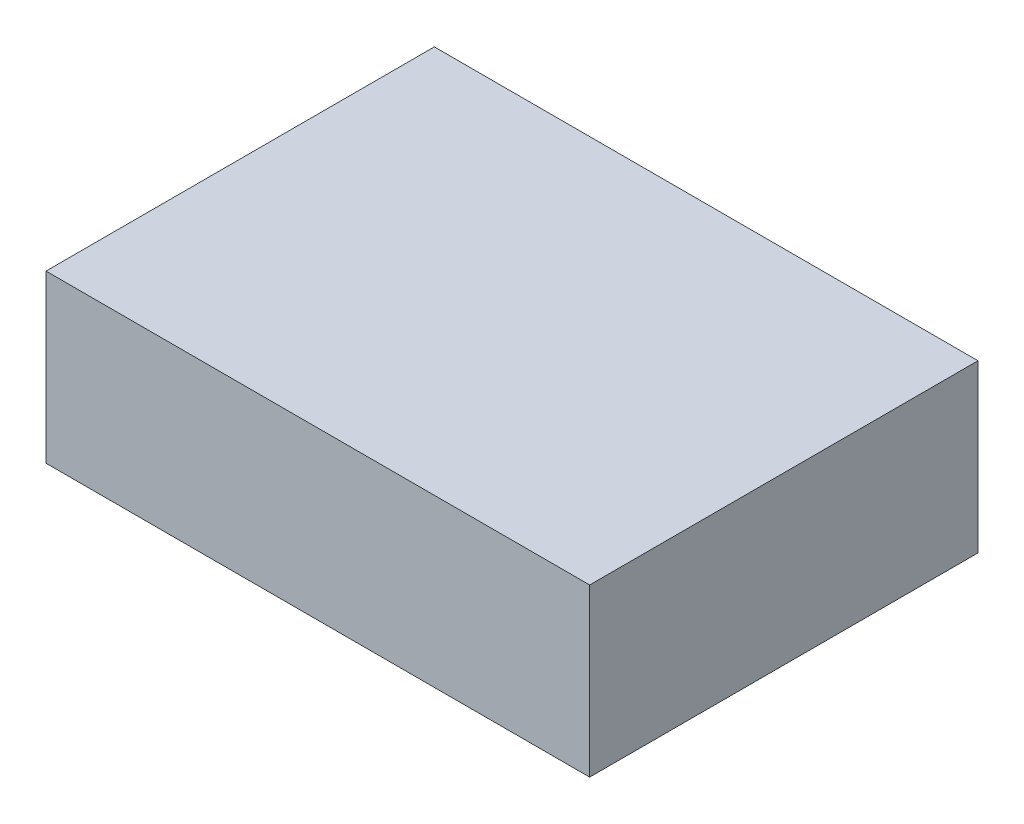
ISO-10303-21;
HEADER;
FILE_DESCRIPTION(('STEP AP214'),'2;1');
FILE_NAME('part.step','',(''),(''),'','','');
FILE_SCHEMA(('AUTOMOTIVE_DESIGN { 1 0 10303 214 1 1 1 1 }'));
ENDSEC;
DATA;
#1=APPLICATION_CONTEXT('core data for automotive mechanical design processes');
#2=APPLICATION_PROTOCOL_DEFINITION('international standard','automotive_design',2000,#1);
#3=PRODUCT_CONTEXT('',#1,'mechanical');
#4=PRODUCT('Part','Part','',(#3));
#5=PRODUCT_RELATED_PRODUCT_CATEGORY('part','',(#4));
#6=PRODUCT_DEFINITION_FORMATION('','',#4);
#7=PRODUCT_DEFINITION_CONTEXT('part definition',#1,'design');
#8=PRODUCT_DEFINITION('design','',#6,#7);
#9=PRODUCT_DEFINITION_SHAPE('','',#8);
#10=(LENGTH_UNIT() NAMED_UNIT(*) SI_UNIT(.MILLI.,.METRE.));
#11=(NAMED_UNIT(*) PLANE_ANGLE_UNIT() SI_UNIT($,.RADIAN.));
#12=(NAMED_UNIT(*) SI_UNIT($,.STERADIAN.) SOLID_ANGLE_UNIT());
#13=UNCERTAINTY_MEASURE_WITH_UNIT(LENGTH_MEASURE(1.E-05),#10,'distance_accuracy_value','');
#14=(GEOMETRIC_REPRESENTATION_CONTEXT(3) GLOBAL_UNCERTAINTY_ASSIGNED_CONTEXT((#13)) GLOBAL_UNIT_ASSIGNED_CONTEXT((#10,
#11,#12)) REPRESENTATION_CONTEXT('',''));
#15=CARTESIAN_POINT('',(0.,0.,0.));
#16=DIRECTION('',(0.,0.,1.));
#17=DIRECTION('',(1.,0.,0.));
#18=AXIS2_PLACEMENT_3D('',#15,#16,#17);
#19=CARTESIAN_POINT('',(0.,38.1,0.));
#20=DIRECTION('',(1.,0.,0.));
#21=DIRECTION('',(0.,0.,-1.));
#22=AXIS2_PLACEMENT_3D('',#19,#20,#21);
#23=PLANE('',#22);
#24=DIRECTION('',(0.,0.,1.));
#25=VECTOR('',#24,1.);
#26=CARTESIAN_POINT('',(0.,0.,0.));
#27=LINE('',#26,#25);
#28=CARTESIAN_POINT('',(0.,0.,-88.9));
#29=VERTEX_POINT('',#28);
#30=CARTESIAN_POINT('',(0.,0.,0.));
#31=VERTEX_POINT('',#30);
#32=EDGE_CURVE('E94',#29,#31,#27,.T.);
#33=ORIENTED_EDGE('',*,*,#32,.T.);
#34=DIRECTION('',(0.,-1.,0.));
#35=VECTOR('',#34,1.);
#36=CARTESIAN_POINT('',(0.,38.1,0.));
#37=LINE('',#36,#35);
#38=CARTESIAN_POINT('',(0.,38.1,0.));
#39=VERTEX_POINT('',#38);
#40=EDGE_CURVE('E11',#39,#31,#37,.T.);
#41=ORIENTED_EDGE('',*,*,#40,.F.);
#42=DIRECTION('',(0.,0.,1.));
#43=VECTOR('',#42,1.);
#44=CARTESIAN_POINT('',(0.,38.1,0.));
#45=LINE('',#44,#43);
#46=CARTESIAN_POINT('',(0.,38.1,-88.9));
#47=VERTEX_POINT('',#46);
#48=EDGE_CURVE('E82',#47,#39,#45,.T.);
#49=ORIENTED_EDGE('',*,*,#48,.F.);
#50=DIRECTION('',(0.,-1.,0.));
#51=VECTOR('',#50,1.);
#52=CARTESIAN_POINT('',(0.,38.1,-88.9));
#53=LINE('',#52,#51);
#54=EDGE_CURVE('E90',#47,#29,#53,.T.);
#55=ORIENTED_EDGE('',*,*,#54,.T.);
#56=EDGE_LOOP('',(#33,#41,#49,#55));
#57=FACE_BOUND('',#56,.T.);
#58=ADVANCED_FACE('F31',(#57),#23,.F.);
#59=CARTESIAN_POINT('',(0.,38.1,0.));
#60=DIRECTION('',(0.,0.,-1.));
#61=DIRECTION('',(-1.,0.,0.));
#62=AXIS2_PLACEMENT_3D('',#59,#60,#61);
#63=PLANE('',#62);
#64=DIRECTION('',(1.,0.,0.));
#65=VECTOR('',#64,1.);
#66=CARTESIAN_POINT('',(0.,0.,0.));
#67=LINE('',#66,#65);
#68=CARTESIAN_POINT('',(124.46,0.,0.));
#69=VERTEX_POINT('',#68);
#70=EDGE_CURVE('E86',#31,#69,#67,.T.);
#71=ORIENTED_EDGE('',*,*,#70,.T.);
#72=DIRECTION('',(0.,-1.,0.));
#73=VECTOR('',#72,1.);
#74=CARTESIAN_POINT('',(124.46,38.1,0.));
#75=LINE('',#74,#73);
#76=CARTESIAN_POINT('',(124.46,38.1,0.));
#77=VERTEX_POINT('',#76);
#78=EDGE_CURVE('E39',#77,#69,#75,.T.);
#79=ORIENTED_EDGE('',*,*,#78,.F.);
#80=DIRECTION('',(1.,0.,0.));
#81=VECTOR('',#80,1.);
#82=CARTESIAN_POINT('',(0.,38.1,0.));
#83=LINE('',#82,#81);
#84=EDGE_CURVE('E77',#39,#77,#83,.T.);
#85=ORIENTED_EDGE('',*,*,#84,.F.);
#86=ORIENTED_EDGE('',*,*,#40,.T.);
#87=EDGE_LOOP('',(#71,#79,#85,#86));
#88=FACE_BOUND('',#87,.T.);
#89=ADVANCED_FACE('F85',(#88),#63,.F.);
#90=CARTESIAN_POINT('',(124.46,38.1,0.));
#91=DIRECTION('',(-1.,0.,0.));
#92=DIRECTION('',(0.,0.,1.));
#93=AXIS2_PLACEMENT_3D('',#90,#91,#92);
#94=PLANE('',#93);
#95=DIRECTION('',(0.,0.,-1.));
#96=VECTOR('',#95,1.);
#97=CARTESIAN_POINT('',(124.46,0.,0.));
#98=LINE('',#97,#96);
#99=CARTESIAN_POINT('',(124.46,0.,-88.9));
#100=VERTEX_POINT('',#99);
#101=EDGE_CURVE('E64',#69,#100,#98,.T.);
#102=ORIENTED_EDGE('',*,*,#101,.T.);
#103=DIRECTION('',(0.,-1.,0.));
#104=VECTOR('',#103,1.);
#105=CARTESIAN_POINT('',(124.46,38.1,-88.9));
#106=LINE('',#105,#104);
#107=CARTESIAN_POINT('',(124.46,38.1,-88.9));
#108=VERTEX_POINT('',#107);
#109=EDGE_CURVE('E87',#108,#100,#106,.T.);
#110=ORIENTED_EDGE('',*,*,#109,.F.);
#111=DIRECTION('',(0.,0.,-1.));
#112=VECTOR('',#111,1.);
#113=CARTESIAN_POINT('',(124.46,38.1,0.));
#114=LINE('',#113,#112);
#115=EDGE_CURVE('E80',#77,#108,#114,.T.);
#116=ORIENTED_EDGE('',*,*,#115,.F.);
#117=ORIENTED_EDGE('',*,*,#78,.T.);
#118=EDGE_LOOP('',(#102,#110,#116,#117));
#119=FACE_BOUND('',#118,.T.);
#120=ADVANCED_FACE('F88',(#119),#94,.F.);
#121=CARTESIAN_POINT('',(0.,38.1,-88.9));
#122=DIRECTION('',(0.,0.,1.));
#123=DIRECTION('',(1.,0.,0.));
#124=AXIS2_PLACEMENT_3D('',#121,#122,#123);
#125=PLANE('',#124);
#126=DIRECTION('',(-1.,0.,0.));
#127=VECTOR('',#126,1.);
#128=CARTESIAN_POINT('',(0.,0.,-88.9));
#129=LINE('',#128,#127);
#130=EDGE_CURVE('E70',#100,#29,#129,.T.);
#131=ORIENTED_EDGE('',*,*,#130,.T.);
#132=ORIENTED_EDGE('',*,*,#54,.F.);
#133=DIRECTION('',(-1.,0.,0.));
#134=VECTOR('',#133,1.);
#135=CARTESIAN_POINT('',(0.,38.1,-88.9));
#136=LINE('',#135,#134);
#137=EDGE_CURVE('E47',#108,#47,#136,.T.);
#138=ORIENTED_EDGE('',*,*,#137,.F.);
#139=ORIENTED_EDGE('',*,*,#109,.T.);
#140=EDGE_LOOP('',(#131,#132,#138,#139));
#141=FACE_BOUND('',#140,.T.);
#142=ADVANCED_FACE('F101',(#141),#125,.F.);
#143=CARTESIAN_POINT('',(0.,38.1,-88.9));
#144=DIRECTION('',(0.,-1.,0.));
#145=DIRECTION('',(0.,0.,-1.));
#146=AXIS2_PLACEMENT_3D('',#143,#144,#145);
#147=PLANE('',#146);
#148=ORIENTED_EDGE('',*,*,#48,.T.);
#149=ORIENTED_EDGE('',*,*,#84,.T.);
#150=ORIENTED_EDGE('',*,*,#115,.T.);
#151=ORIENTED_EDGE('',*,*,#137,.T.);
#152=EDGE_LOOP('',(#148,#149,#150,#151));
#153=FACE_BOUND('',#152,.T.);
#154=ADVANCED_FACE('F78',(#153),#147,.F.);
#155=CARTESIAN_POINT('',(0.,0.,-88.9));
#156=DIRECTION('',(0.,-1.,0.));
#157=DIRECTION('',(0.,0.,-1.));
#158=AXIS2_PLACEMENT_3D('',#155,#156,#157);
#159=PLANE('',#158);
#160=ORIENTED_EDGE('',*,*,#32,.F.);
#161=ORIENTED_EDGE('',*,*,#130,.F.);
#162=ORIENTED_EDGE('',*,*,#101,.F.);
#163=ORIENTED_EDGE('',*,*,#70,.F.);
#164=EDGE_LOOP('',(#160,#161,#162,#163));
#165=FACE_BOUND('',#164,.T.);
#166=ADVANCED_FACE('F104',(#165),#159,.T.);
#167=CLOSED_SHELL('',(#58,#89,#120,#142,#154,#166));
#168=MANIFOLD_SOLID_BREP('B2',#167);
#169=ADVANCED_BREP_SHAPE_REPRESENTATION('',(#18,#168),#14);
#170=SHAPE_DEFINITION_REPRESENTATION(#9,#169);
ENDSEC;
END-ISO-10303-21;
